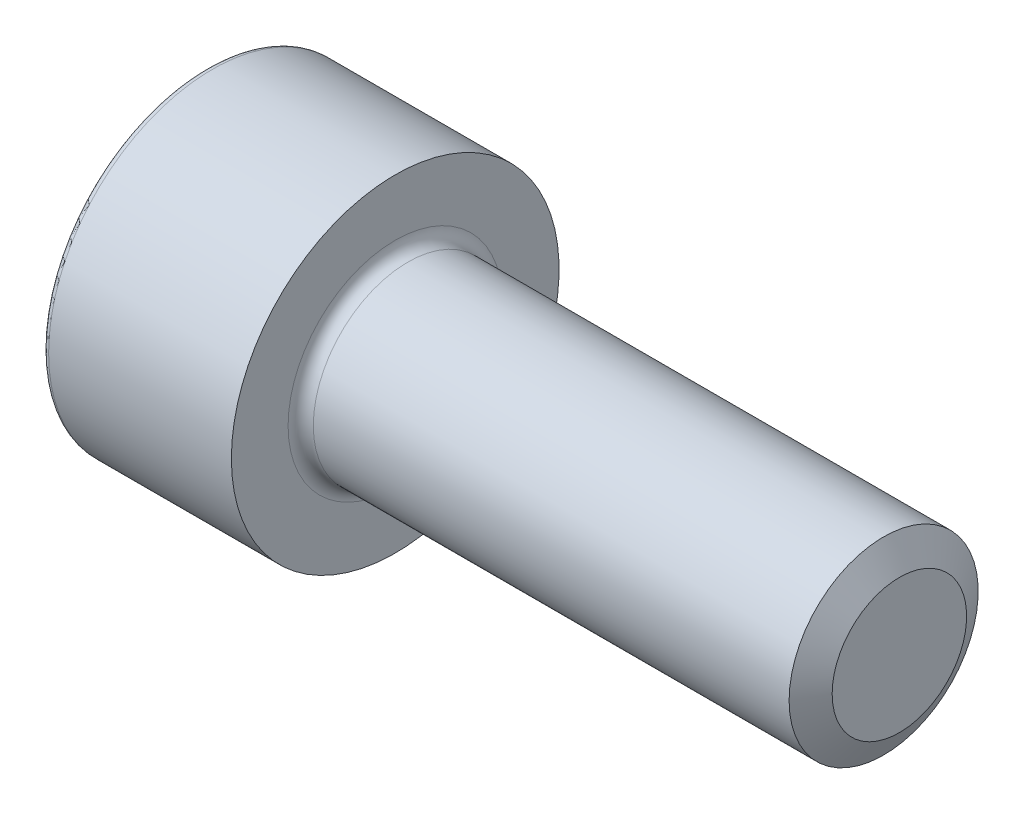
ISO-10303-21;
HEADER;
FILE_DESCRIPTION(('STEP AP214'),'2;1');
FILE_NAME('part.step','',(''),(''),'','','');
FILE_SCHEMA(('AUTOMOTIVE_DESIGN { 1 0 10303 214 1 1 1 1 }'));
ENDSEC;
DATA;
#1=APPLICATION_CONTEXT('core data for automotive mechanical design processes');
#2=APPLICATION_PROTOCOL_DEFINITION('international standard','automotive_design',2000,#1);
#3=PRODUCT_CONTEXT('',#1,'mechanical');
#4=PRODUCT('Part','Part','',(#3));
#5=PRODUCT_RELATED_PRODUCT_CATEGORY('part','',(#4));
#6=PRODUCT_DEFINITION_FORMATION('','',#4);
#7=PRODUCT_DEFINITION_CONTEXT('part definition',#1,'design');
#8=PRODUCT_DEFINITION('design','',#6,#7);
#9=PRODUCT_DEFINITION_SHAPE('','',#8);
#10=(LENGTH_UNIT() NAMED_UNIT(*) SI_UNIT(.MILLI.,.METRE.));
#11=(NAMED_UNIT(*) PLANE_ANGLE_UNIT() SI_UNIT($,.RADIAN.));
#12=(NAMED_UNIT(*) SI_UNIT($,.STERADIAN.) SOLID_ANGLE_UNIT());
#13=UNCERTAINTY_MEASURE_WITH_UNIT(LENGTH_MEASURE(1.E-05),#10,'distance_accuracy_value','');
#14=(GEOMETRIC_REPRESENTATION_CONTEXT(3) GLOBAL_UNCERTAINTY_ASSIGNED_CONTEXT((#13)) GLOBAL_UNIT_ASSIGNED_CONTEXT((#10,
#11,#12)) REPRESENTATION_CONTEXT('',''));
#15=CARTESIAN_POINT('',(0.,0.,0.));
#16=DIRECTION('',(0.,0.,1.));
#17=DIRECTION('',(1.,0.,0.));
#18=AXIS2_PLACEMENT_3D('',#15,#16,#17);
#19=CARTESIAN_POINT('',(0.,0.,0.));
#20=DIRECTION('',(-1.,0.,0.));
#21=DIRECTION('',(0.,0.,1.));
#22=AXIS2_PLACEMENT_3D('',#19,#20,#21);
#23=CYLINDRICAL_SURFACE('',#22,1.5);
#24=CARTESIAN_POINT('',(3.2,0.,0.));
#25=DIRECTION('',(-1.,0.,0.));
#26=DIRECTION('',(0.,0.,1.));
#27=AXIS2_PLACEMENT_3D('',#24,#25,#26);
#28=CIRCLE('',#27,1.5);
#29=CARTESIAN_POINT('',(3.2,0.,1.5));
#30=VERTEX_POINT('',#29);
#31=EDGE_CURVE('E142',#30,#30,#28,.T.);
#32=ORIENTED_EDGE('',*,*,#31,.F.);
#33=EDGE_LOOP('',(#32));
#34=FACE_BOUND('',#33,.T.);
#35=CARTESIAN_POINT('',(10.7500073334409,0.,0.));
#36=DIRECTION('',(-1.,0.,0.));
#37=DIRECTION('',(0.,0.,1.));
#38=AXIS2_PLACEMENT_3D('',#35,#36,#37);
#39=CIRCLE('',#38,1.5);
#40=CARTESIAN_POINT('',(10.7500073334409,0.,1.5));
#41=VERTEX_POINT('',#40);
#42=EDGE_CURVE('E279',#41,#41,#39,.T.);
#43=ORIENTED_EDGE('',*,*,#42,.T.);
#44=EDGE_LOOP('',(#43));
#45=FACE_BOUND('',#44,.T.);
#46=ADVANCED_FACE('F39',(#34,#45),#23,.T.);
#47=CARTESIAN_POINT('',(0.,0.,0.));
#48=DIRECTION('',(1.,0.,0.));
#49=DIRECTION('',(0.,0.,-1.));
#50=AXIS2_PLACEMENT_3D('',#47,#48,#49);
#51=PLANE('',#50);
#52=CARTESIAN_POINT('',(0.,0.,0.));
#53=DIRECTION('',(1.,0.,0.));
#54=DIRECTION('',(0.,0.,-1.));
#55=AXIS2_PLACEMENT_3D('',#52,#53,#54);
#56=CIRCLE('',#55,2.5);
#57=CARTESIAN_POINT('',(0.,0.,-2.5));
#58=VERTEX_POINT('',#57);
#59=EDGE_CURVE('E47',#58,#58,#56,.F.);
#60=ORIENTED_EDGE('',*,*,#59,.T.);
#61=EDGE_LOOP('',(#60));
#62=FACE_BOUND('',#61,.T.);
#63=DIRECTION('',(0.,0.866025403784439,-0.5));
#64=VECTOR('',#63,1.);
#65=CARTESIAN_POINT('',(0.,0.,1.435));
#66=LINE('',#65,#64);
#67=CARTESIAN_POINT('',(0.,0.,1.435));
#68=VERTEX_POINT('',#67);
#69=CARTESIAN_POINT('',(0.,1.24274645443067,0.717499999999999));
#70=VERTEX_POINT('',#69);
#71=EDGE_CURVE('E128',#68,#70,#66,.T.);
#72=ORIENTED_EDGE('',*,*,#71,.F.);
#73=DIRECTION('',(0.,0.866025403784439,0.5));
#74=VECTOR('',#73,1.);
#75=CARTESIAN_POINT('',(0.,-1.24274645443067,0.7175));
#76=LINE('',#75,#74);
#77=CARTESIAN_POINT('',(0.,-1.24274645443067,0.7175));
#78=VERTEX_POINT('',#77);
#79=EDGE_CURVE('E54',#78,#68,#76,.T.);
#80=ORIENTED_EDGE('',*,*,#79,.F.);
#81=DIRECTION('',(0.,0.,1.));
#82=VECTOR('',#81,1.);
#83=CARTESIAN_POINT('',(0.,-1.24274645443067,-0.7175));
#84=LINE('',#83,#82);
#85=CARTESIAN_POINT('',(0.,-1.24274645443067,-0.7175));
#86=VERTEX_POINT('',#85);
#87=EDGE_CURVE('E138',#86,#78,#84,.T.);
#88=ORIENTED_EDGE('',*,*,#87,.F.);
#89=DIRECTION('',(0.,-0.866025403784439,0.5));
#90=VECTOR('',#89,1.);
#91=CARTESIAN_POINT('',(0.,0.,-1.435));
#92=LINE('',#91,#90);
#93=CARTESIAN_POINT('',(0.,0.,-1.435));
#94=VERTEX_POINT('',#93);
#95=EDGE_CURVE('E136',#94,#86,#92,.T.);
#96=ORIENTED_EDGE('',*,*,#95,.F.);
#97=DIRECTION('',(0.,-0.866025403784439,-0.5));
#98=VECTOR('',#97,1.);
#99=CARTESIAN_POINT('',(0.,1.24274645443067,-0.7175));
#100=LINE('',#99,#98);
#101=CARTESIAN_POINT('',(0.,1.24274645443067,-0.7175));
#102=VERTEX_POINT('',#101);
#103=EDGE_CURVE('E102',#102,#94,#100,.T.);
#104=ORIENTED_EDGE('',*,*,#103,.F.);
#105=DIRECTION('',(0.,0.,-1.));
#106=VECTOR('',#105,1.);
#107=CARTESIAN_POINT('',(0.,1.24274645443067,0.717499999999999));
#108=LINE('',#107,#106);
#109=EDGE_CURVE('E132',#70,#102,#108,.T.);
#110=ORIENTED_EDGE('',*,*,#109,.F.);
#111=EDGE_LOOP('',(#72,#80,#88,#96,#104,#110));
#112=FACE_BOUND('',#111,.T.);
#113=ADVANCED_FACE('F159',(#62,#112),#51,.F.);
#114=CARTESIAN_POINT('',(0.,0.,0.));
#115=DIRECTION('',(-1.,0.,0.));
#116=DIRECTION('',(0.,0.,1.));
#117=AXIS2_PLACEMENT_3D('',#114,#115,#116);
#118=CYLINDRICAL_SURFACE('',#117,2.6);
#119=CARTESIAN_POINT('',(0.1,0.,0.));
#120=DIRECTION('',(1.,0.,0.));
#121=DIRECTION('',(0.,0.,-1.));
#122=AXIS2_PLACEMENT_3D('',#119,#120,#121);
#123=CIRCLE('',#122,2.6);
#124=CARTESIAN_POINT('',(0.1,0.,-2.6));
#125=VERTEX_POINT('',#124);
#126=EDGE_CURVE('E11',#125,#125,#123,.T.);
#127=ORIENTED_EDGE('',*,*,#126,.T.);
#128=EDGE_LOOP('',(#127));
#129=FACE_BOUND('',#128,.T.);
#130=CARTESIAN_POINT('',(3.,0.,0.));
#131=DIRECTION('',(-1.,0.,0.));
#132=DIRECTION('',(0.,0.,1.));
#133=AXIS2_PLACEMENT_3D('',#130,#131,#132);
#134=CIRCLE('',#133,2.6);
#135=CARTESIAN_POINT('',(3.,0.,2.6));
#136=VERTEX_POINT('',#135);
#137=EDGE_CURVE('E153',#136,#136,#134,.T.);
#138=ORIENTED_EDGE('',*,*,#137,.T.);
#139=EDGE_LOOP('',(#138));
#140=FACE_BOUND('',#139,.T.);
#141=ADVANCED_FACE('F178',(#129,#140),#118,.T.);
#142=CARTESIAN_POINT('',(3.,2.6,0.));
#143=DIRECTION('',(-1.,0.,0.));
#144=DIRECTION('',(0.,0.,1.));
#145=AXIS2_PLACEMENT_3D('',#142,#143,#144);
#146=PLANE('',#145);
#147=ORIENTED_EDGE('',*,*,#137,.F.);
#148=EDGE_LOOP('',(#147));
#149=FACE_BOUND('',#148,.T.);
#150=CARTESIAN_POINT('',(3.,0.,0.));
#151=DIRECTION('',(-1.,0.,0.));
#152=DIRECTION('',(0.,0.,1.));
#153=AXIS2_PLACEMENT_3D('',#150,#151,#152);
#154=CIRCLE('',#153,1.7);
#155=CARTESIAN_POINT('',(3.,0.,1.7));
#156=VERTEX_POINT('',#155);
#157=EDGE_CURVE('E150',#156,#156,#154,.T.);
#158=ORIENTED_EDGE('',*,*,#157,.T.);
#159=EDGE_LOOP('',(#158));
#160=FACE_BOUND('',#159,.T.);
#161=ADVANCED_FACE('F187',(#149,#160),#146,.F.);
#162=CARTESIAN_POINT('',(3.2,0.,0.));
#163=DIRECTION('',(-1.,0.,0.));
#164=DIRECTION('',(0.,0.,1.));
#165=AXIS2_PLACEMENT_3D('',#162,#163,#164);
#166=TOROIDAL_SURFACE('',#165,1.7,0.2);
#167=ORIENTED_EDGE('',*,*,#157,.F.);
#168=EDGE_LOOP('',(#167));
#169=FACE_BOUND('',#168,.T.);
#170=ORIENTED_EDGE('',*,*,#31,.T.);
#171=EDGE_LOOP('',(#170));
#172=FACE_BOUND('',#171,.T.);
#173=ADVANCED_FACE('F183',(#169,#172),#166,.F.);
#174=CARTESIAN_POINT('',(1.3,-1.24274645443067,0.7175));
#175=DIRECTION('',(0.,-0.5,0.866025403784439));
#176=DIRECTION('',(0.,-0.866025403784439,-0.5));
#177=AXIS2_PLACEMENT_3D('',#174,#175,#176);
#178=PLANE('',#177);
#179=ORIENTED_EDGE('',*,*,#79,.T.);
#180=DIRECTION('',(-1.,0.,0.));
#181=VECTOR('',#180,1.);
#182=CARTESIAN_POINT('',(1.3,0.,1.435));
#183=LINE('',#182,#181);
#184=CARTESIAN_POINT('',(1.3,0.,1.435));
#185=VERTEX_POINT('',#184);
#186=EDGE_CURVE('E84',#185,#68,#183,.T.);
#187=ORIENTED_EDGE('',*,*,#186,.F.);
#188=DIRECTION('',(0.,0.866025403784439,0.5));
#189=VECTOR('',#188,1.);
#190=CARTESIAN_POINT('',(1.3,-1.24274645443067,0.7175));
#191=LINE('',#190,#189);
#192=CARTESIAN_POINT('',(1.3,-1.24274645443067,0.7175));
#193=VERTEX_POINT('',#192);
#194=EDGE_CURVE('E140',#193,#185,#191,.T.);
#195=ORIENTED_EDGE('',*,*,#194,.F.);
#196=DIRECTION('',(-1.,0.,0.));
#197=VECTOR('',#196,1.);
#198=CARTESIAN_POINT('',(1.3,-1.24274645443067,0.7175));
#199=LINE('',#198,#197);
#200=EDGE_CURVE('E62',#193,#78,#199,.T.);
#201=ORIENTED_EDGE('',*,*,#200,.T.);
#202=EDGE_LOOP('',(#179,#187,#195,#201));
#203=FACE_BOUND('',#202,.T.);
#204=ADVANCED_FACE('F186',(#203),#178,.F.);
#205=CARTESIAN_POINT('',(1.3,-1.24274645443067,-0.7175));
#206=DIRECTION('',(0.,-1.,0.));
#207=DIRECTION('',(0.,0.,-1.));
#208=AXIS2_PLACEMENT_3D('',#205,#206,#207);
#209=PLANE('',#208);
#210=ORIENTED_EDGE('',*,*,#87,.T.);
#211=ORIENTED_EDGE('',*,*,#200,.F.);
#212=DIRECTION('',(0.,0.,1.));
#213=VECTOR('',#212,1.);
#214=CARTESIAN_POINT('',(1.3,-1.24274645443067,-0.7175));
#215=LINE('',#214,#213);
#216=CARTESIAN_POINT('',(1.3,-1.24274645443067,-0.7175));
#217=VERTEX_POINT('',#216);
#218=EDGE_CURVE('E114',#217,#193,#215,.T.);
#219=ORIENTED_EDGE('',*,*,#218,.F.);
#220=DIRECTION('',(-1.,0.,0.));
#221=VECTOR('',#220,1.);
#222=CARTESIAN_POINT('',(1.3,-1.24274645443067,-0.7175));
#223=LINE('',#222,#221);
#224=EDGE_CURVE('E106',#217,#86,#223,.T.);
#225=ORIENTED_EDGE('',*,*,#224,.T.);
#226=EDGE_LOOP('',(#210,#211,#219,#225));
#227=FACE_BOUND('',#226,.T.);
#228=ADVANCED_FACE('F217',(#227),#209,.F.);
#229=CARTESIAN_POINT('',(1.3,0.,-1.435));
#230=DIRECTION('',(0.,-0.5,-0.866025403784439));
#231=DIRECTION('',(0.,0.866025403784439,-0.5));
#232=AXIS2_PLACEMENT_3D('',#229,#230,#231);
#233=PLANE('',#232);
#234=ORIENTED_EDGE('',*,*,#95,.T.);
#235=ORIENTED_EDGE('',*,*,#224,.F.);
#236=DIRECTION('',(0.,-0.866025403784439,0.5));
#237=VECTOR('',#236,1.);
#238=CARTESIAN_POINT('',(1.3,0.,-1.435));
#239=LINE('',#238,#237);
#240=CARTESIAN_POINT('',(1.3,0.,-1.435));
#241=VERTEX_POINT('',#240);
#242=EDGE_CURVE('E110',#241,#217,#239,.T.);
#243=ORIENTED_EDGE('',*,*,#242,.F.);
#244=DIRECTION('',(-1.,0.,0.));
#245=VECTOR('',#244,1.);
#246=CARTESIAN_POINT('',(1.3,0.,-1.435));
#247=LINE('',#246,#245);
#248=EDGE_CURVE('E95',#241,#94,#247,.T.);
#249=ORIENTED_EDGE('',*,*,#248,.T.);
#250=EDGE_LOOP('',(#234,#235,#243,#249));
#251=FACE_BOUND('',#250,.T.);
#252=ADVANCED_FACE('F111',(#251),#233,.F.);
#253=CARTESIAN_POINT('',(1.3,1.24274645443067,-0.7175));
#254=DIRECTION('',(0.,0.5,-0.866025403784439));
#255=DIRECTION('',(0.,0.866025403784439,0.5));
#256=AXIS2_PLACEMENT_3D('',#253,#254,#255);
#257=PLANE('',#256);
#258=ORIENTED_EDGE('',*,*,#103,.T.);
#259=ORIENTED_EDGE('',*,*,#248,.F.);
#260=DIRECTION('',(0.,-0.866025403784439,-0.5));
#261=VECTOR('',#260,1.);
#262=CARTESIAN_POINT('',(1.3,1.24274645443067,-0.7175));
#263=LINE('',#262,#261);
#264=CARTESIAN_POINT('',(1.3,1.24274645443067,-0.7175));
#265=VERTEX_POINT('',#264);
#266=EDGE_CURVE('E99',#265,#241,#263,.T.);
#267=ORIENTED_EDGE('',*,*,#266,.F.);
#268=DIRECTION('',(-1.,0.,0.));
#269=VECTOR('',#268,1.);
#270=CARTESIAN_POINT('',(1.3,1.24274645443067,-0.7175));
#271=LINE('',#270,#269);
#272=EDGE_CURVE('E107',#265,#102,#271,.T.);
#273=ORIENTED_EDGE('',*,*,#272,.T.);
#274=EDGE_LOOP('',(#258,#259,#267,#273));
#275=FACE_BOUND('',#274,.T.);
#276=ADVANCED_FACE('F97',(#275),#257,.F.);
#277=CARTESIAN_POINT('',(1.3,1.24274645443067,0.717499999999999));
#278=DIRECTION('',(0.,1.,0.));
#279=DIRECTION('',(0.,0.,1.));
#280=AXIS2_PLACEMENT_3D('',#277,#278,#279);
#281=PLANE('',#280);
#282=ORIENTED_EDGE('',*,*,#109,.T.);
#283=ORIENTED_EDGE('',*,*,#272,.F.);
#284=DIRECTION('',(0.,0.,-1.));
#285=VECTOR('',#284,1.);
#286=CARTESIAN_POINT('',(1.3,1.24274645443067,0.717499999999999));
#287=LINE('',#286,#285);
#288=CARTESIAN_POINT('',(1.3,1.24274645443067,0.717499999999999));
#289=VERTEX_POINT('',#288);
#290=EDGE_CURVE('E120',#289,#265,#287,.T.);
#291=ORIENTED_EDGE('',*,*,#290,.F.);
#292=DIRECTION('',(-1.,0.,0.));
#293=VECTOR('',#292,1.);
#294=CARTESIAN_POINT('',(1.3,1.24274645443067,0.717499999999999));
#295=LINE('',#294,#293);
#296=EDGE_CURVE('E145',#289,#70,#295,.T.);
#297=ORIENTED_EDGE('',*,*,#296,.T.);
#298=EDGE_LOOP('',(#282,#283,#291,#297));
#299=FACE_BOUND('',#298,.T.);
#300=ADVANCED_FACE('F235',(#299),#281,.F.);
#301=CARTESIAN_POINT('',(1.3,0.,1.435));
#302=DIRECTION('',(0.,0.5,0.866025403784439));
#303=DIRECTION('',(0.,-0.866025403784439,0.5));
#304=AXIS2_PLACEMENT_3D('',#301,#302,#303);
#305=PLANE('',#304);
#306=ORIENTED_EDGE('',*,*,#71,.T.);
#307=ORIENTED_EDGE('',*,*,#296,.F.);
#308=DIRECTION('',(0.,0.866025403784439,-0.5));
#309=VECTOR('',#308,1.);
#310=CARTESIAN_POINT('',(1.3,0.,1.435));
#311=LINE('',#310,#309);
#312=EDGE_CURVE('E122',#185,#289,#311,.T.);
#313=ORIENTED_EDGE('',*,*,#312,.F.);
#314=ORIENTED_EDGE('',*,*,#186,.T.);
#315=EDGE_LOOP('',(#306,#307,#313,#314));
#316=FACE_BOUND('',#315,.T.);
#317=ADVANCED_FACE('F242',(#316),#305,.F.);
#318=CARTESIAN_POINT('',(1.3,-1.24274645443067,0.7175));
#319=DIRECTION('',(1.,0.,0.));
#320=DIRECTION('',(0.,0.,-1.));
#321=AXIS2_PLACEMENT_3D('',#318,#319,#320);
#322=PLANE('',#321);
#323=ORIENTED_EDGE('',*,*,#194,.T.);
#324=ORIENTED_EDGE('',*,*,#312,.T.);
#325=ORIENTED_EDGE('',*,*,#290,.T.);
#326=ORIENTED_EDGE('',*,*,#266,.T.);
#327=ORIENTED_EDGE('',*,*,#242,.T.);
#328=ORIENTED_EDGE('',*,*,#218,.T.);
#329=EDGE_LOOP('',(#323,#324,#325,#326,#327,#328));
#330=FACE_BOUND('',#329,.T.);
#331=ADVANCED_FACE('F117',(#330),#322,.F.);
#332=CARTESIAN_POINT('',(10.7500073334409,0.,0.));
#333=DIRECTION('',(-1.,0.,0.));
#334=DIRECTION('',(0.,0.,1.));
#335=AXIS2_PLACEMENT_3D('',#332,#333,#334);
#336=CONICAL_SURFACE('',#335,1.5,1.0471975511966);
#337=CARTESIAN_POINT('',(11.,0.,0.));
#338=DIRECTION('',(-1.,0.,0.));
#339=DIRECTION('',(0.,0.,1.));
#340=AXIS2_PLACEMENT_3D('',#337,#338,#339);
#341=CIRCLE('',#340,1.067);
#342=CARTESIAN_POINT('',(11.,0.,1.067));
#343=VERTEX_POINT('',#342);
#344=EDGE_CURVE('E129',#343,#343,#341,.T.);
#345=ORIENTED_EDGE('',*,*,#344,.T.);
#346=EDGE_LOOP('',(#345));
#347=FACE_BOUND('',#346,.T.);
#348=ORIENTED_EDGE('',*,*,#42,.F.);
#349=EDGE_LOOP('',(#348));
#350=FACE_BOUND('',#349,.T.);
#351=ADVANCED_FACE('F168',(#347,#350),#336,.T.);
#352=CARTESIAN_POINT('',(11.,1.5,0.));
#353=DIRECTION('',(-1.,0.,0.));
#354=DIRECTION('',(0.,0.,1.));
#355=AXIS2_PLACEMENT_3D('',#352,#353,#354);
#356=PLANE('',#355);
#357=ORIENTED_EDGE('',*,*,#344,.F.);
#358=EDGE_LOOP('',(#357));
#359=FACE_BOUND('',#358,.T.);
#360=ADVANCED_FACE('F163',(#359),#356,.F.);
#361=CARTESIAN_POINT('',(0.1,0.,0.));
#362=DIRECTION('',(1.,0.,0.));
#363=DIRECTION('',(0.,0.,-1.));
#364=AXIS2_PLACEMENT_3D('',#361,#362,#363);
#365=TOROIDAL_SURFACE('',#364,2.5,0.1);
#366=ORIENTED_EDGE('',*,*,#126,.F.);
#367=EDGE_LOOP('',(#366));
#368=FACE_BOUND('',#367,.T.);
#369=ORIENTED_EDGE('',*,*,#59,.F.);
#370=EDGE_LOOP('',(#369));
#371=FACE_BOUND('',#370,.T.);
#372=ADVANCED_FACE('F41',(#368,#371),#365,.T.);
#373=CLOSED_SHELL('',(#46,#113,#141,#161,#173,#204,#228,#252,#276,#300,#317,#331,#351,#360,#372));
#374=MANIFOLD_SOLID_BREP('B2',#373);
#375=ADVANCED_BREP_SHAPE_REPRESENTATION('',(#18,#374),#14);
#376=SHAPE_DEFINITION_REPRESENTATION(#9,#375);
ENDSEC;
END-ISO-10303-21;
